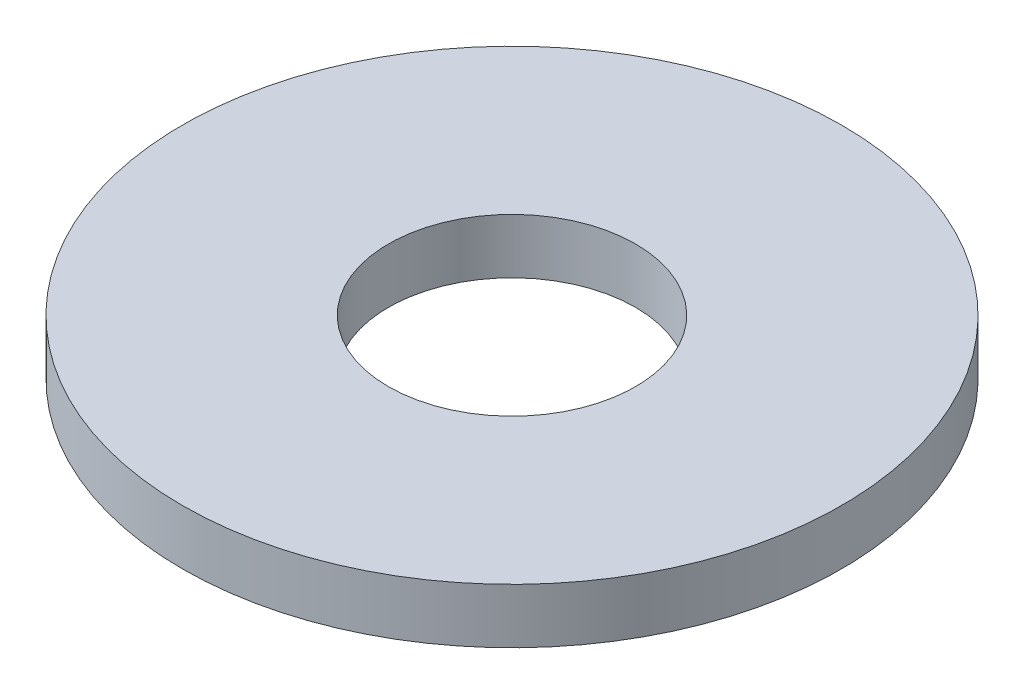
ISO-10303-21;
HEADER;
FILE_DESCRIPTION(('STEP AP214'),'2;1');
FILE_NAME('part.step','',(''),(''),'','','');
FILE_SCHEMA(('AUTOMOTIVE_DESIGN { 1 0 10303 214 1 1 1 1 }'));
ENDSEC;
DATA;
#1=APPLICATION_CONTEXT('core data for automotive mechanical design processes');
#2=APPLICATION_PROTOCOL_DEFINITION('international standard','automotive_design',2000,#1);
#3=PRODUCT_CONTEXT('',#1,'mechanical');
#4=PRODUCT('Part','Part','',(#3));
#5=PRODUCT_RELATED_PRODUCT_CATEGORY('part','',(#4));
#6=PRODUCT_DEFINITION_FORMATION('','',#4);
#7=PRODUCT_DEFINITION_CONTEXT('part definition',#1,'design');
#8=PRODUCT_DEFINITION('design','',#6,#7);
#9=PRODUCT_DEFINITION_SHAPE('','',#8);
#10=(LENGTH_UNIT() NAMED_UNIT(*) SI_UNIT(.MILLI.,.METRE.));
#11=(NAMED_UNIT(*) PLANE_ANGLE_UNIT() SI_UNIT($,.RADIAN.));
#12=(NAMED_UNIT(*) SI_UNIT($,.STERADIAN.) SOLID_ANGLE_UNIT());
#13=UNCERTAINTY_MEASURE_WITH_UNIT(LENGTH_MEASURE(1.E-05),#10,'distance_accuracy_value','');
#14=(GEOMETRIC_REPRESENTATION_CONTEXT(3) GLOBAL_UNCERTAINTY_ASSIGNED_CONTEXT((#13)) GLOBAL_UNIT_ASSIGNED_CONTEXT((#10,
#11,#12)) REPRESENTATION_CONTEXT('',''));
#15=CARTESIAN_POINT('',(0.,0.,0.));
#16=DIRECTION('',(0.,0.,1.));
#17=DIRECTION('',(1.,0.,0.));
#18=AXIS2_PLACEMENT_3D('',#15,#16,#17);
#19=CARTESIAN_POINT('',(0.,1.,0.));
#20=DIRECTION('',(0.,1.,0.));
#21=DIRECTION('',(0.,0.,1.));
#22=AXIS2_PLACEMENT_3D('',#19,#20,#21);
#23=PLANE('',#22);
#24=CARTESIAN_POINT('',(0.,1.,0.));
#25=DIRECTION('',(0.,1.,0.));
#26=DIRECTION('',(0.,0.,1.));
#27=AXIS2_PLACEMENT_3D('',#24,#25,#26);
#28=CIRCLE('',#27,6.);
#29=CARTESIAN_POINT('',(0.,1.,6.));
#30=VERTEX_POINT('',#29);
#31=EDGE_CURVE('E10',#30,#30,#28,.T.);
#32=ORIENTED_EDGE('',*,*,#31,.T.);
#33=EDGE_LOOP('',(#32));
#34=FACE_BOUND('',#33,.T.);
#35=CARTESIAN_POINT('',(0.,1.,0.));
#36=DIRECTION('',(0.,1.,0.));
#37=DIRECTION('',(0.,0.,1.));
#38=AXIS2_PLACEMENT_3D('',#35,#36,#37);
#39=CIRCLE('',#38,2.25);
#40=CARTESIAN_POINT('',(0.,1.,2.25));
#41=VERTEX_POINT('',#40);
#42=EDGE_CURVE('E44',#41,#41,#39,.T.);
#43=ORIENTED_EDGE('',*,*,#42,.F.);
#44=EDGE_LOOP('',(#43));
#45=FACE_BOUND('',#44,.T.);
#46=ADVANCED_FACE('F33',(#34,#45),#23,.T.);
#47=CARTESIAN_POINT('',(0.,0.,0.));
#48=DIRECTION('',(0.,1.,0.));
#49=DIRECTION('',(0.,0.,1.));
#50=AXIS2_PLACEMENT_3D('',#47,#48,#49);
#51=PLANE('',#50);
#52=CARTESIAN_POINT('',(0.,0.,0.));
#53=DIRECTION('',(0.,1.,0.));
#54=DIRECTION('',(0.,0.,1.));
#55=AXIS2_PLACEMENT_3D('',#52,#53,#54);
#56=CIRCLE('',#55,6.);
#57=CARTESIAN_POINT('',(0.,0.,6.));
#58=VERTEX_POINT('',#57);
#59=EDGE_CURVE('E37',#58,#58,#56,.T.);
#60=ORIENTED_EDGE('',*,*,#59,.F.);
#61=EDGE_LOOP('',(#60));
#62=FACE_BOUND('',#61,.T.);
#63=CARTESIAN_POINT('',(0.,0.,0.));
#64=DIRECTION('',(0.,1.,0.));
#65=DIRECTION('',(0.,0.,1.));
#66=AXIS2_PLACEMENT_3D('',#63,#64,#65);
#67=CIRCLE('',#66,2.25);
#68=CARTESIAN_POINT('',(0.,0.,2.25));
#69=VERTEX_POINT('',#68);
#70=EDGE_CURVE('E46',#69,#69,#67,.T.);
#71=ORIENTED_EDGE('',*,*,#70,.T.);
#72=EDGE_LOOP('',(#71));
#73=FACE_BOUND('',#72,.T.);
#74=ADVANCED_FACE('F56',(#62,#73),#51,.F.);
#75=CARTESIAN_POINT('',(0.,1.,0.));
#76=DIRECTION('',(0.,-1.,0.));
#77=DIRECTION('',(0.,0.,-1.));
#78=AXIS2_PLACEMENT_3D('',#75,#76,#77);
#79=CYLINDRICAL_SURFACE('',#78,6.);
#80=ORIENTED_EDGE('',*,*,#31,.F.);
#81=EDGE_LOOP('',(#80));
#82=FACE_BOUND('',#81,.T.);
#83=ORIENTED_EDGE('',*,*,#59,.T.);
#84=EDGE_LOOP('',(#83));
#85=FACE_BOUND('',#84,.T.);
#86=ADVANCED_FACE('F35',(#82,#85),#79,.T.);
#87=CARTESIAN_POINT('',(0.,1.,0.));
#88=DIRECTION('',(0.,-1.,0.));
#89=DIRECTION('',(0.,0.,-1.));
#90=AXIS2_PLACEMENT_3D('',#87,#88,#89);
#91=CYLINDRICAL_SURFACE('',#90,2.25);
#92=ORIENTED_EDGE('',*,*,#42,.T.);
#93=EDGE_LOOP('',(#92));
#94=FACE_BOUND('',#93,.T.);
#95=ORIENTED_EDGE('',*,*,#70,.F.);
#96=EDGE_LOOP('',(#95));
#97=FACE_BOUND('',#96,.T.);
#98=ADVANCED_FACE('F52',(#94,#97),#91,.F.);
#99=CLOSED_SHELL('',(#46,#74,#86,#98));
#100=MANIFOLD_SOLID_BREP('B2',#99);
#101=ADVANCED_BREP_SHAPE_REPRESENTATION('',(#18,#100),#14);
#102=SHAPE_DEFINITION_REPRESENTATION(#9,#101);
ENDSEC;
END-ISO-10303-21;
